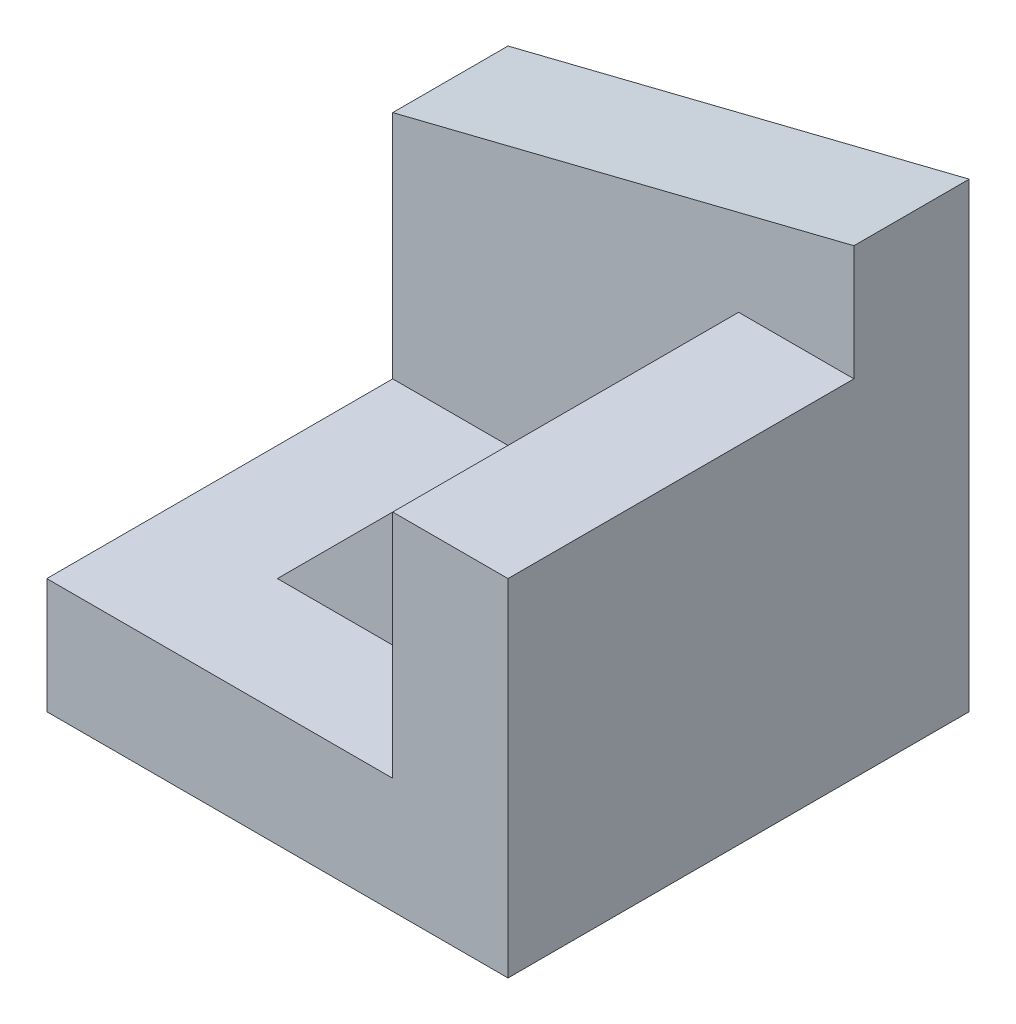
ISO-10303-21;
HEADER;
FILE_DESCRIPTION(('STEP AP214'),'2;1');
FILE_NAME('part.step','',(''),(''),'','','');
FILE_SCHEMA(('AUTOMOTIVE_DESIGN { 1 0 10303 214 1 1 1 1 }'));
ENDSEC;
DATA;
#1=APPLICATION_CONTEXT('core data for automotive mechanical design processes');
#2=APPLICATION_PROTOCOL_DEFINITION('international standard','automotive_design',2000,#1);
#3=PRODUCT_CONTEXT('',#1,'mechanical');
#4=PRODUCT('Part','Part','',(#3));
#5=PRODUCT_RELATED_PRODUCT_CATEGORY('part','',(#4));
#6=PRODUCT_DEFINITION_FORMATION('','',#4);
#7=PRODUCT_DEFINITION_CONTEXT('part definition',#1,'design');
#8=PRODUCT_DEFINITION('design','',#6,#7);
#9=PRODUCT_DEFINITION_SHAPE('','',#8);
#10=(LENGTH_UNIT() NAMED_UNIT(*) SI_UNIT(.MILLI.,.METRE.));
#11=(NAMED_UNIT(*) PLANE_ANGLE_UNIT() SI_UNIT($,.RADIAN.));
#12=(NAMED_UNIT(*) SI_UNIT($,.STERADIAN.) SOLID_ANGLE_UNIT());
#13=UNCERTAINTY_MEASURE_WITH_UNIT(LENGTH_MEASURE(1.E-05),#10,'distance_accuracy_value','');
#14=(GEOMETRIC_REPRESENTATION_CONTEXT(3) GLOBAL_UNCERTAINTY_ASSIGNED_CONTEXT((#13)) GLOBAL_UNIT_ASSIGNED_CONTEXT((#10,
#11,#12)) REPRESENTATION_CONTEXT('',''));
#15=CARTESIAN_POINT('',(0.,0.,0.));
#16=DIRECTION('',(0.,0.,1.));
#17=DIRECTION('',(1.,0.,0.));
#18=AXIS2_PLACEMENT_3D('',#15,#16,#17);
#19=CARTESIAN_POINT('',(0.,0.,40.));
#20=DIRECTION('',(0.,0.,-1.));
#21=DIRECTION('',(-1.,0.,0.));
#22=AXIS2_PLACEMENT_3D('',#19,#20,#21);
#23=PLANE('',#22);
#24=DIRECTION('',(0.,-1.,0.));
#25=VECTOR('',#24,1.);
#26=CARTESIAN_POINT('',(30.,0.,40.));
#27=LINE('',#26,#25);
#28=CARTESIAN_POINT('',(30.,30.,40.));
#29=VERTEX_POINT('',#28);
#30=CARTESIAN_POINT('',(30.,10.,40.));
#31=VERTEX_POINT('',#30);
#32=EDGE_CURVE('E114',#29,#31,#27,.T.);
#33=ORIENTED_EDGE('',*,*,#32,.T.);
#34=DIRECTION('',(1.,0.,0.));
#35=VECTOR('',#34,1.);
#36=CARTESIAN_POINT('',(-20.,9.99999999999999,40.));
#37=LINE('',#36,#35);
#38=CARTESIAN_POINT('',(0.,9.99999999999999,40.));
#39=VERTEX_POINT('',#38);
#40=EDGE_CURVE('E194',#39,#31,#37,.T.);
#41=ORIENTED_EDGE('',*,*,#40,.F.);
#42=DIRECTION('',(0.,-1.,0.));
#43=VECTOR('',#42,1.);
#44=CARTESIAN_POINT('',(0.,0.,40.));
#45=LINE('',#44,#43);
#46=CARTESIAN_POINT('',(0.,0.,40.));
#47=VERTEX_POINT('',#46);
#48=EDGE_CURVE('E154',#39,#47,#45,.T.);
#49=ORIENTED_EDGE('',*,*,#48,.T.);
#50=DIRECTION('',(1.,0.,0.));
#51=VECTOR('',#50,1.);
#52=CARTESIAN_POINT('',(0.,0.,40.));
#53=LINE('',#52,#51);
#54=CARTESIAN_POINT('',(40.,0.,40.));
#55=VERTEX_POINT('',#54);
#56=EDGE_CURVE('E156',#47,#55,#53,.T.);
#57=ORIENTED_EDGE('',*,*,#56,.T.);
#58=DIRECTION('',(0.,1.,0.));
#59=VECTOR('',#58,1.);
#60=CARTESIAN_POINT('',(40.,0.,40.));
#61=LINE('',#60,#59);
#62=CARTESIAN_POINT('',(40.,30.,40.));
#63=VERTEX_POINT('',#62);
#64=EDGE_CURVE('E159',#55,#63,#61,.T.);
#65=ORIENTED_EDGE('',*,*,#64,.T.);
#66=DIRECTION('',(1.,0.,0.));
#67=VECTOR('',#66,1.);
#68=CARTESIAN_POINT('',(0.,30.,40.));
#69=LINE('',#68,#67);
#70=EDGE_CURVE('E144',#29,#63,#69,.T.);
#71=ORIENTED_EDGE('',*,*,#70,.F.);
#72=EDGE_LOOP('',(#33,#41,#49,#57,#65,#71));
#73=FACE_BOUND('',#72,.T.);
#74=ADVANCED_FACE('F33',(#73),#23,.F.);
#75=CARTESIAN_POINT('',(0.,0.,10.));
#76=DIRECTION('',(-0.707106781186547,0.707106781186547,0.));
#77=DIRECTION('',(-0.707106781186548,-0.707106781186548,0.));
#78=AXIS2_PLACEMENT_3D('',#75,#76,#77);
#79=PLANE('',#78);
#80=DIRECTION('',(0.,0.,1.));
#81=VECTOR('',#80,1.);
#82=CARTESIAN_POINT('',(10.,10.,10.));
#83=LINE('',#82,#81);
#84=CARTESIAN_POINT('',(10.,10.,10.));
#85=VERTEX_POINT('',#84);
#86=CARTESIAN_POINT('',(10.,10.,30.));
#87=VERTEX_POINT('',#86);
#88=EDGE_CURVE('E130',#85,#87,#83,.T.);
#89=ORIENTED_EDGE('',*,*,#88,.T.);
#90=DIRECTION('',(-0.707106781186548,-0.707106781186548,0.));
#91=VECTOR('',#90,1.);
#92=CARTESIAN_POINT('',(0.,0.,30.));
#93=LINE('',#92,#91);
#94=CARTESIAN_POINT('',(30.,30.,30.));
#95=VERTEX_POINT('',#94);
#96=EDGE_CURVE('E123',#95,#87,#93,.T.);
#97=ORIENTED_EDGE('',*,*,#96,.F.);
#98=DIRECTION('',(0.,0.,1.));
#99=VECTOR('',#98,1.);
#100=CARTESIAN_POINT('',(30.,30.,10.));
#101=LINE('',#100,#99);
#102=CARTESIAN_POINT('',(30.,30.,10.));
#103=VERTEX_POINT('',#102);
#104=EDGE_CURVE('E128',#103,#95,#101,.T.);
#105=ORIENTED_EDGE('',*,*,#104,.F.);
#106=DIRECTION('',(-0.707106781186548,-0.707106781186548,0.));
#107=VECTOR('',#106,1.);
#108=CARTESIAN_POINT('',(0.,0.,10.));
#109=LINE('',#108,#107);
#110=EDGE_CURVE('E56',#103,#85,#109,.T.);
#111=ORIENTED_EDGE('',*,*,#110,.T.);
#112=EDGE_LOOP('',(#89,#97,#105,#111));
#113=FACE_BOUND('',#112,.T.);
#114=ADVANCED_FACE('F127',(#113),#79,.T.);
#115=CARTESIAN_POINT('',(0.,30.,40.));
#116=DIRECTION('',(0.,-1.,0.));
#117=DIRECTION('',(0.,0.,-1.));
#118=AXIS2_PLACEMENT_3D('',#115,#116,#117);
#119=PLANE('',#118);
#120=ORIENTED_EDGE('',*,*,#104,.T.);
#121=DIRECTION('',(0.,0.,1.));
#122=VECTOR('',#121,1.);
#123=CARTESIAN_POINT('',(30.,30.,30.));
#124=LINE('',#123,#122);
#125=EDGE_CURVE('E108',#95,#29,#124,.T.);
#126=ORIENTED_EDGE('',*,*,#125,.T.);
#127=ORIENTED_EDGE('',*,*,#70,.T.);
#128=DIRECTION('',(0.,0.,-1.));
#129=VECTOR('',#128,1.);
#130=CARTESIAN_POINT('',(40.,30.,40.));
#131=LINE('',#130,#129);
#132=CARTESIAN_POINT('',(40.,30.,10.));
#133=VERTEX_POINT('',#132);
#134=EDGE_CURVE('E135',#63,#133,#131,.T.);
#135=ORIENTED_EDGE('',*,*,#134,.T.);
#136=DIRECTION('',(1.,0.,0.));
#137=VECTOR('',#136,1.);
#138=CARTESIAN_POINT('',(0.,30.,10.));
#139=LINE('',#138,#137);
#140=EDGE_CURVE('E134',#103,#133,#139,.T.);
#141=ORIENTED_EDGE('',*,*,#140,.F.);
#142=EDGE_LOOP('',(#120,#126,#127,#135,#141));
#143=FACE_BOUND('',#142,.T.);
#144=ADVANCED_FACE('F132',(#143),#119,.F.);
#145=CARTESIAN_POINT('',(0.,0.,40.));
#146=DIRECTION('',(1.,0.,0.));
#147=DIRECTION('',(0.,0.,-1.));
#148=AXIS2_PLACEMENT_3D('',#145,#146,#147);
#149=PLANE('',#148);
#150=DIRECTION('',(0.,0.,-1.));
#151=VECTOR('',#150,1.);
#152=CARTESIAN_POINT('',(0.,9.99999999999999,40.));
#153=LINE('',#152,#151);
#154=CARTESIAN_POINT('',(0.,10.,10.));
#155=VERTEX_POINT('',#154);
#156=EDGE_CURVE('E197',#39,#155,#153,.T.);
#157=ORIENTED_EDGE('',*,*,#156,.T.);
#158=DIRECTION('',(0.,1.,0.));
#159=VECTOR('',#158,1.);
#160=CARTESIAN_POINT('',(0.,0.,10.));
#161=LINE('',#160,#159);
#162=CARTESIAN_POINT('',(0.,30.,10.));
#163=VERTEX_POINT('',#162);
#164=EDGE_CURVE('E201',#155,#163,#161,.T.);
#165=ORIENTED_EDGE('',*,*,#164,.T.);
#166=DIRECTION('',(0.,0.,1.));
#167=VECTOR('',#166,1.);
#168=CARTESIAN_POINT('',(0.,30.,0.));
#169=LINE('',#168,#167);
#170=CARTESIAN_POINT('',(0.,30.,0.));
#171=VERTEX_POINT('',#170);
#172=EDGE_CURVE('E150',#171,#163,#169,.T.);
#173=ORIENTED_EDGE('',*,*,#172,.F.);
#174=DIRECTION('',(0.,-1.,0.));
#175=VECTOR('',#174,1.);
#176=CARTESIAN_POINT('',(0.,0.,0.));
#177=LINE('',#176,#175);
#178=CARTESIAN_POINT('',(0.,0.,0.));
#179=VERTEX_POINT('',#178);
#180=EDGE_CURVE('E153',#171,#179,#177,.T.);
#181=ORIENTED_EDGE('',*,*,#180,.T.);
#182=DIRECTION('',(0.,0.,-1.));
#183=VECTOR('',#182,1.);
#184=CARTESIAN_POINT('',(0.,0.,40.));
#185=LINE('',#184,#183);
#186=EDGE_CURVE('E41',#47,#179,#185,.T.);
#187=ORIENTED_EDGE('',*,*,#186,.F.);
#188=ORIENTED_EDGE('',*,*,#48,.F.);
#189=EDGE_LOOP('',(#157,#165,#173,#181,#187,#188));
#190=FACE_BOUND('',#189,.T.);
#191=ADVANCED_FACE('F35',(#190),#149,.F.);
#192=CARTESIAN_POINT('',(0.,0.,40.));
#193=DIRECTION('',(0.,1.,0.));
#194=DIRECTION('',(0.,0.,1.));
#195=AXIS2_PLACEMENT_3D('',#192,#193,#194);
#196=PLANE('',#195);
#197=DIRECTION('',(1.,0.,0.));
#198=VECTOR('',#197,1.);
#199=CARTESIAN_POINT('',(0.,0.,0.));
#200=LINE('',#199,#198);
#201=CARTESIAN_POINT('',(40.,0.,0.));
#202=VERTEX_POINT('',#201);
#203=EDGE_CURVE('E164',#179,#202,#200,.T.);
#204=ORIENTED_EDGE('',*,*,#203,.T.);
#205=DIRECTION('',(0.,0.,-1.));
#206=VECTOR('',#205,1.);
#207=CARTESIAN_POINT('',(40.,0.,40.));
#208=LINE('',#207,#206);
#209=EDGE_CURVE('E169',#55,#202,#208,.T.);
#210=ORIENTED_EDGE('',*,*,#209,.F.);
#211=ORIENTED_EDGE('',*,*,#56,.F.);
#212=ORIENTED_EDGE('',*,*,#186,.T.);
#213=EDGE_LOOP('',(#204,#210,#211,#212));
#214=FACE_BOUND('',#213,.T.);
#215=ADVANCED_FACE('F175',(#214),#196,.F.);
#216=CARTESIAN_POINT('',(40.,0.,40.));
#217=DIRECTION('',(-1.,0.,0.));
#218=DIRECTION('',(0.,0.,1.));
#219=AXIS2_PLACEMENT_3D('',#216,#217,#218);
#220=PLANE('',#219);
#221=DIRECTION('',(0.,0.,-1.));
#222=VECTOR('',#221,1.);
#223=CARTESIAN_POINT('',(40.,40.,40.));
#224=LINE('',#223,#222);
#225=CARTESIAN_POINT('',(40.,40.,10.));
#226=VERTEX_POINT('',#225);
#227=CARTESIAN_POINT('',(40.,40.,0.));
#228=VERTEX_POINT('',#227);
#229=EDGE_CURVE('E162',#226,#228,#224,.T.);
#230=ORIENTED_EDGE('',*,*,#229,.F.);
#231=DIRECTION('',(0.,1.,0.));
#232=VECTOR('',#231,1.);
#233=CARTESIAN_POINT('',(40.,40.,10.));
#234=LINE('',#233,#232);
#235=EDGE_CURVE('E137',#133,#226,#234,.T.);
#236=ORIENTED_EDGE('',*,*,#235,.F.);
#237=ORIENTED_EDGE('',*,*,#134,.F.);
#238=ORIENTED_EDGE('',*,*,#64,.F.);
#239=ORIENTED_EDGE('',*,*,#209,.T.);
#240=DIRECTION('',(0.,1.,0.));
#241=VECTOR('',#240,1.);
#242=CARTESIAN_POINT('',(40.,0.,0.));
#243=LINE('',#242,#241);
#244=EDGE_CURVE('E157',#202,#228,#243,.T.);
#245=ORIENTED_EDGE('',*,*,#244,.T.);
#246=EDGE_LOOP('',(#230,#236,#237,#238,#239,#245));
#247=FACE_BOUND('',#246,.T.);
#248=ADVANCED_FACE('F188',(#247),#220,.F.);
#249=CARTESIAN_POINT('',(0.,0.,0.));
#250=DIRECTION('',(0.,0.,-1.));
#251=DIRECTION('',(-1.,0.,0.));
#252=AXIS2_PLACEMENT_3D('',#249,#250,#251);
#253=PLANE('',#252);
#254=DIRECTION('',(0.970142500145332,0.242535625036333,0.));
#255=VECTOR('',#254,1.);
#256=CARTESIAN_POINT('',(40.,40.,0.));
#257=LINE('',#256,#255);
#258=EDGE_CURVE('E146',#171,#228,#257,.T.);
#259=ORIENTED_EDGE('',*,*,#258,.T.);
#260=ORIENTED_EDGE('',*,*,#244,.F.);
#261=ORIENTED_EDGE('',*,*,#203,.F.);
#262=ORIENTED_EDGE('',*,*,#180,.F.);
#263=EDGE_LOOP('',(#259,#260,#261,#262));
#264=FACE_BOUND('',#263,.T.);
#265=ADVANCED_FACE('F185',(#264),#253,.T.);
#266=CARTESIAN_POINT('',(40.,40.,0.));
#267=DIRECTION('',(0.242535625036334,-0.970142500145332,0.));
#268=DIRECTION('',(0.970142500145332,0.242535625036334,0.));
#269=AXIS2_PLACEMENT_3D('',#266,#267,#268);
#270=PLANE('',#269);
#271=ORIENTED_EDGE('',*,*,#172,.T.);
#272=DIRECTION('',(0.970142500145332,0.242535625036334,0.));
#273=VECTOR('',#272,1.);
#274=CARTESIAN_POINT('',(40.,40.,10.));
#275=LINE('',#274,#273);
#276=EDGE_CURVE('E11',#163,#226,#275,.T.);
#277=ORIENTED_EDGE('',*,*,#276,.T.);
#278=ORIENTED_EDGE('',*,*,#229,.T.);
#279=ORIENTED_EDGE('',*,*,#258,.F.);
#280=EDGE_LOOP('',(#271,#277,#278,#279));
#281=FACE_BOUND('',#280,.T.);
#282=ADVANCED_FACE('F206',(#281),#270,.F.);
#283=CARTESIAN_POINT('',(0.,40.,10.));
#284=DIRECTION('',(0.,0.,-1.));
#285=DIRECTION('',(-1.,0.,0.));
#286=AXIS2_PLACEMENT_3D('',#283,#284,#285);
#287=PLANE('',#286);
#288=ORIENTED_EDGE('',*,*,#276,.F.);
#289=ORIENTED_EDGE('',*,*,#164,.F.);
#290=DIRECTION('',(1.,0.,0.));
#291=VECTOR('',#290,1.);
#292=CARTESIAN_POINT('',(-20.,10.,10.));
#293=LINE('',#292,#291);
#294=EDGE_CURVE('E195',#155,#85,#293,.T.);
#295=ORIENTED_EDGE('',*,*,#294,.T.);
#296=ORIENTED_EDGE('',*,*,#110,.F.);
#297=ORIENTED_EDGE('',*,*,#140,.T.);
#298=ORIENTED_EDGE('',*,*,#235,.T.);
#299=EDGE_LOOP('',(#288,#289,#295,#296,#297,#298));
#300=FACE_BOUND('',#299,.T.);
#301=ADVANCED_FACE('F204',(#300),#287,.F.);
#302=CARTESIAN_POINT('',(-20.,10.,10.));
#303=DIRECTION('',(0.,-1.,0.));
#304=DIRECTION('',(0.,0.,-1.));
#305=AXIS2_PLACEMENT_3D('',#302,#303,#304);
#306=PLANE('',#305);
#307=ORIENTED_EDGE('',*,*,#40,.T.);
#308=DIRECTION('',(0.,0.,1.));
#309=VECTOR('',#308,1.);
#310=CARTESIAN_POINT('',(30.,10.,30.));
#311=LINE('',#310,#309);
#312=CARTESIAN_POINT('',(30.,10.,30.));
#313=VERTEX_POINT('',#312);
#314=EDGE_CURVE('E118',#313,#31,#311,.T.);
#315=ORIENTED_EDGE('',*,*,#314,.F.);
#316=DIRECTION('',(1.,0.,0.));
#317=VECTOR('',#316,1.);
#318=CARTESIAN_POINT('',(0.,10.,30.));
#319=LINE('',#318,#317);
#320=EDGE_CURVE('E48',#87,#313,#319,.T.);
#321=ORIENTED_EDGE('',*,*,#320,.F.);
#322=ORIENTED_EDGE('',*,*,#88,.F.);
#323=ORIENTED_EDGE('',*,*,#294,.F.);
#324=ORIENTED_EDGE('',*,*,#156,.F.);
#325=EDGE_LOOP('',(#307,#315,#321,#322,#323,#324));
#326=FACE_BOUND('',#325,.T.);
#327=ADVANCED_FACE('F213',(#326),#306,.F.);
#328=CARTESIAN_POINT('',(30.,0.,30.));
#329=DIRECTION('',(-1.,0.,0.));
#330=DIRECTION('',(0.,0.,1.));
#331=AXIS2_PLACEMENT_3D('',#328,#329,#330);
#332=PLANE('',#331);
#333=ORIENTED_EDGE('',*,*,#32,.F.);
#334=ORIENTED_EDGE('',*,*,#125,.F.);
#335=DIRECTION('',(0.,-1.,0.));
#336=VECTOR('',#335,1.);
#337=CARTESIAN_POINT('',(30.,0.,30.));
#338=LINE('',#337,#336);
#339=EDGE_CURVE('E112',#95,#313,#338,.T.);
#340=ORIENTED_EDGE('',*,*,#339,.T.);
#341=ORIENTED_EDGE('',*,*,#314,.T.);
#342=EDGE_LOOP('',(#333,#334,#340,#341));
#343=FACE_BOUND('',#342,.T.);
#344=ADVANCED_FACE('F110',(#343),#332,.T.);
#345=CARTESIAN_POINT('',(0.,0.,30.));
#346=DIRECTION('',(0.,0.,1.));
#347=DIRECTION('',(1.,0.,0.));
#348=AXIS2_PLACEMENT_3D('',#345,#346,#347);
#349=PLANE('',#348);
#350=ORIENTED_EDGE('',*,*,#339,.F.);
#351=ORIENTED_EDGE('',*,*,#96,.T.);
#352=ORIENTED_EDGE('',*,*,#320,.T.);
#353=EDGE_LOOP('',(#350,#351,#352));
#354=FACE_BOUND('',#353,.T.);
#355=ADVANCED_FACE('F122',(#354),#349,.T.);
#356=CLOSED_SHELL('',(#74,#114,#144,#191,#215,#248,#265,#282,#301,#327,#344,#355));
#357=MANIFOLD_SOLID_BREP('B2',#356);
#358=ADVANCED_BREP_SHAPE_REPRESENTATION('',(#18,#357),#14);
#359=SHAPE_DEFINITION_REPRESENTATION(#9,#358);
ENDSEC;
END-ISO-10303-21;
